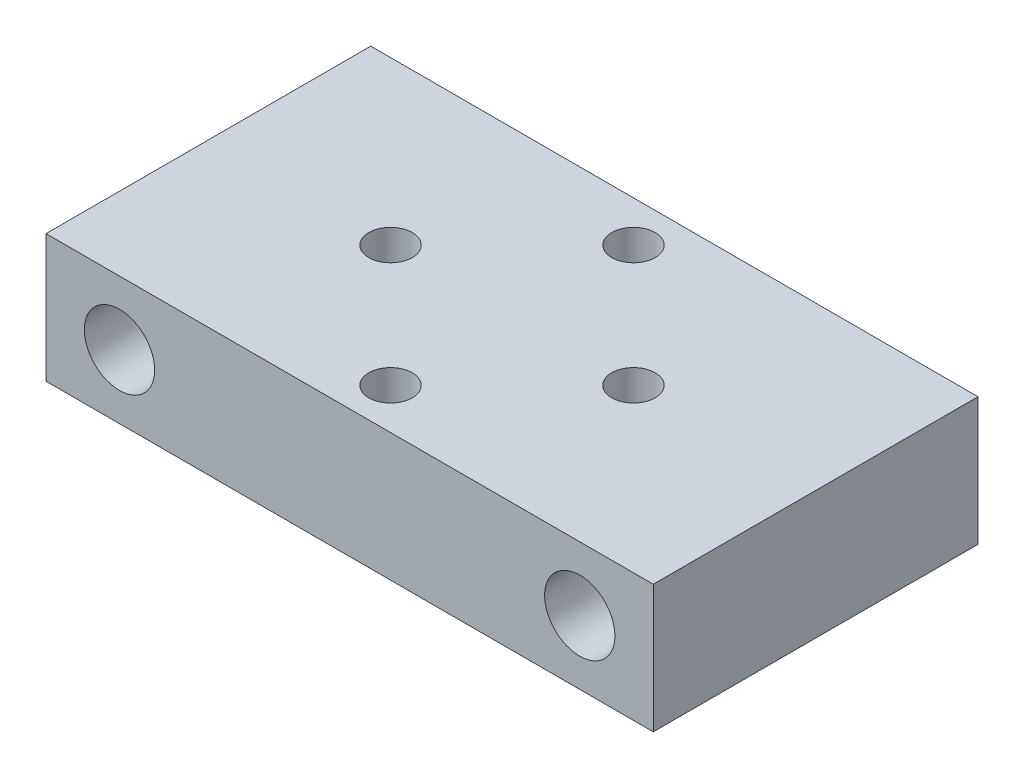
ISO-10303-21;
HEADER;
FILE_DESCRIPTION(('STEP AP214'),'2;1');
FILE_NAME('part.step','',(''),(''),'','','');
FILE_SCHEMA(('AUTOMOTIVE_DESIGN { 1 0 10303 214 1 1 1 1 }'));
ENDSEC;
DATA;
#1=APPLICATION_CONTEXT('core data for automotive mechanical design processes');
#2=APPLICATION_PROTOCOL_DEFINITION('international standard','automotive_design',2000,#1);
#3=PRODUCT_CONTEXT('',#1,'mechanical');
#4=PRODUCT('Part','Part','',(#3));
#5=PRODUCT_RELATED_PRODUCT_CATEGORY('part','',(#4));
#6=PRODUCT_DEFINITION_FORMATION('','',#4);
#7=PRODUCT_DEFINITION_CONTEXT('part definition',#1,'design');
#8=PRODUCT_DEFINITION('design','',#6,#7);
#9=PRODUCT_DEFINITION_SHAPE('','',#8);
#10=(LENGTH_UNIT() NAMED_UNIT(*) SI_UNIT(.MILLI.,.METRE.));
#11=(NAMED_UNIT(*) PLANE_ANGLE_UNIT() SI_UNIT($,.RADIAN.));
#12=(NAMED_UNIT(*) SI_UNIT($,.STERADIAN.) SOLID_ANGLE_UNIT());
#13=UNCERTAINTY_MEASURE_WITH_UNIT(LENGTH_MEASURE(1.E-05),#10,'distance_accuracy_value','');
#14=(GEOMETRIC_REPRESENTATION_CONTEXT(3) GLOBAL_UNCERTAINTY_ASSIGNED_CONTEXT((#13)) GLOBAL_UNIT_ASSIGNED_CONTEXT((#10,
#11,#12)) REPRESENTATION_CONTEXT('',''));
#15=CARTESIAN_POINT('',(0.,0.,0.));
#16=DIRECTION('',(0.,0.,1.));
#17=DIRECTION('',(1.,0.,0.));
#18=AXIS2_PLACEMENT_3D('',#15,#16,#17);
#19=CARTESIAN_POINT('',(-23.75,-5.,-12.7));
#20=DIRECTION('',(-1.,0.,0.));
#21=DIRECTION('',(0.,0.,1.));
#22=AXIS2_PLACEMENT_3D('',#19,#20,#21);
#23=PLANE('',#22);
#24=DIRECTION('',(0.,0.,1.));
#25=VECTOR('',#24,1.);
#26=CARTESIAN_POINT('',(-23.75,5.,-12.7));
#27=LINE('',#26,#25);
#28=CARTESIAN_POINT('',(-23.75,5.,-12.7));
#29=VERTEX_POINT('',#28);
#30=CARTESIAN_POINT('',(-23.75,5.,12.7));
#31=VERTEX_POINT('',#30);
#32=EDGE_CURVE('E156',#29,#31,#27,.T.);
#33=ORIENTED_EDGE('',*,*,#32,.F.);
#34=DIRECTION('',(0.,1.,0.));
#35=VECTOR('',#34,1.);
#36=CARTESIAN_POINT('',(-23.75,-5.,-12.7));
#37=LINE('',#36,#35);
#38=CARTESIAN_POINT('',(-23.75,-5.,-12.7));
#39=VERTEX_POINT('',#38);
#40=EDGE_CURVE('E11',#39,#29,#37,.T.);
#41=ORIENTED_EDGE('',*,*,#40,.F.);
#42=DIRECTION('',(0.,0.,1.));
#43=VECTOR('',#42,1.);
#44=CARTESIAN_POINT('',(-23.75,-5.,-12.7));
#45=LINE('',#44,#43);
#46=CARTESIAN_POINT('',(-23.75,-5.,12.7));
#47=VERTEX_POINT('',#46);
#48=EDGE_CURVE('E157',#39,#47,#45,.T.);
#49=ORIENTED_EDGE('',*,*,#48,.T.);
#50=DIRECTION('',(0.,1.,0.));
#51=VECTOR('',#50,1.);
#52=CARTESIAN_POINT('',(-23.75,-5.,12.7));
#53=LINE('',#52,#51);
#54=EDGE_CURVE('E36',#47,#31,#53,.T.);
#55=ORIENTED_EDGE('',*,*,#54,.T.);
#56=EDGE_LOOP('',(#33,#41,#49,#55));
#57=FACE_BOUND('',#56,.T.);
#58=ADVANCED_FACE('F33',(#57),#23,.T.);
#59=CARTESIAN_POINT('',(-23.75,-5.,-12.7));
#60=DIRECTION('',(0.,0.,-1.));
#61=DIRECTION('',(-1.,0.,0.));
#62=AXIS2_PLACEMENT_3D('',#59,#60,#61);
#63=PLANE('',#62);
#64=CARTESIAN_POINT('',(-18.,0.,-12.7000000000004));
#65=DIRECTION('',(0.,0.,-1.));
#66=DIRECTION('',(-1.,0.,0.));
#67=AXIS2_PLACEMENT_3D('',#64,#65,#66);
#68=CIRCLE('',#67,2.75);
#69=CARTESIAN_POINT('',(-20.75,0.,-12.7000000000004));
#70=VERTEX_POINT('',#69);
#71=EDGE_CURVE('E98',#70,#70,#68,.T.);
#72=ORIENTED_EDGE('',*,*,#71,.F.);
#73=EDGE_LOOP('',(#72));
#74=FACE_BOUND('',#73,.T.);
#75=CARTESIAN_POINT('',(18.,0.,-12.7000000000004));
#76=DIRECTION('',(0.,0.,-1.));
#77=DIRECTION('',(-1.,0.,0.));
#78=AXIS2_PLACEMENT_3D('',#75,#76,#77);
#79=CIRCLE('',#78,2.75);
#80=CARTESIAN_POINT('',(15.25,0.,-12.7000000000004));
#81=VERTEX_POINT('',#80);
#82=EDGE_CURVE('E97',#81,#81,#79,.T.);
#83=ORIENTED_EDGE('',*,*,#82,.F.);
#84=EDGE_LOOP('',(#83));
#85=FACE_BOUND('',#84,.T.);
#86=DIRECTION('',(-1.,0.,0.));
#87=VECTOR('',#86,1.);
#88=CARTESIAN_POINT('',(-23.75,5.,-12.7));
#89=LINE('',#88,#87);
#90=CARTESIAN_POINT('',(23.7499999999999,5.,-12.7));
#91=VERTEX_POINT('',#90);
#92=EDGE_CURVE('E65',#91,#29,#89,.T.);
#93=ORIENTED_EDGE('',*,*,#92,.F.);
#94=DIRECTION('',(0.,1.,0.));
#95=VECTOR('',#94,1.);
#96=CARTESIAN_POINT('',(23.7499999999999,-5.,-12.7));
#97=LINE('',#96,#95);
#98=CARTESIAN_POINT('',(23.7499999999999,-5.,-12.7));
#99=VERTEX_POINT('',#98);
#100=EDGE_CURVE('E42',#99,#91,#97,.T.);
#101=ORIENTED_EDGE('',*,*,#100,.F.);
#102=DIRECTION('',(-1.,0.,0.));
#103=VECTOR('',#102,1.);
#104=CARTESIAN_POINT('',(23.7499999999999,-5.,-12.7));
#105=LINE('',#104,#103);
#106=EDGE_CURVE('E50',#99,#39,#105,.T.);
#107=ORIENTED_EDGE('',*,*,#106,.T.);
#108=ORIENTED_EDGE('',*,*,#40,.T.);
#109=EDGE_LOOP('',(#93,#101,#107,#108));
#110=FACE_BOUND('',#109,.T.);
#111=ADVANCED_FACE('F185',(#74,#85,#110),#63,.T.);
#112=CARTESIAN_POINT('',(23.7499999999999,-5.,-12.7));
#113=DIRECTION('',(1.,0.,0.));
#114=DIRECTION('',(0.,0.,-1.));
#115=AXIS2_PLACEMENT_3D('',#112,#113,#114);
#116=PLANE('',#115);
#117=DIRECTION('',(0.,0.,-1.));
#118=VECTOR('',#117,1.);
#119=CARTESIAN_POINT('',(23.7499999999999,5.,-12.7));
#120=LINE('',#119,#118);
#121=CARTESIAN_POINT('',(23.7500000000001,5.,12.6999999999998));
#122=VERTEX_POINT('',#121);
#123=EDGE_CURVE('E171',#122,#91,#120,.T.);
#124=ORIENTED_EDGE('',*,*,#123,.F.);
#125=DIRECTION('',(0.,1.,0.));
#126=VECTOR('',#125,1.);
#127=CARTESIAN_POINT('',(23.7500000000001,-5.,12.6999999999998));
#128=LINE('',#127,#126);
#129=CARTESIAN_POINT('',(23.7500000000001,-5.,12.6999999999998));
#130=VERTEX_POINT('',#129);
#131=EDGE_CURVE('E175',#130,#122,#128,.T.);
#132=ORIENTED_EDGE('',*,*,#131,.F.);
#133=DIRECTION('',(0.,0.,-1.));
#134=VECTOR('',#133,1.);
#135=CARTESIAN_POINT('',(23.7499999999999,-5.,-12.7));
#136=LINE('',#135,#134);
#137=EDGE_CURVE('E162',#130,#99,#136,.T.);
#138=ORIENTED_EDGE('',*,*,#137,.T.);
#139=ORIENTED_EDGE('',*,*,#100,.T.);
#140=EDGE_LOOP('',(#124,#132,#138,#139));
#141=FACE_BOUND('',#140,.T.);
#142=ADVANCED_FACE('F183',(#141),#116,.T.);
#143=CARTESIAN_POINT('',(23.7500000000001,-5.,12.6999999999998));
#144=DIRECTION('',(0.,0.,1.));
#145=DIRECTION('',(1.,0.,0.));
#146=AXIS2_PLACEMENT_3D('',#143,#144,#145);
#147=PLANE('',#146);
#148=CARTESIAN_POINT('',(-18.,0.,12.7000000000004));
#149=DIRECTION('',(0.,0.,1.));
#150=DIRECTION('',(1.,0.,0.));
#151=AXIS2_PLACEMENT_3D('',#148,#149,#150);
#152=CIRCLE('',#151,2.75);
#153=CARTESIAN_POINT('',(-15.25,0.,12.7000000000004));
#154=VERTEX_POINT('',#153);
#155=EDGE_CURVE('E108',#154,#154,#152,.T.);
#156=ORIENTED_EDGE('',*,*,#155,.F.);
#157=EDGE_LOOP('',(#156));
#158=FACE_BOUND('',#157,.T.);
#159=CARTESIAN_POINT('',(18.,0.,12.7000000000004));
#160=DIRECTION('',(0.,0.,1.));
#161=DIRECTION('',(1.,0.,0.));
#162=AXIS2_PLACEMENT_3D('',#159,#160,#161);
#163=CIRCLE('',#162,2.75);
#164=CARTESIAN_POINT('',(20.75,0.,12.7000000000004));
#165=VERTEX_POINT('',#164);
#166=EDGE_CURVE('E114',#165,#165,#163,.T.);
#167=ORIENTED_EDGE('',*,*,#166,.F.);
#168=EDGE_LOOP('',(#167));
#169=FACE_BOUND('',#168,.T.);
#170=DIRECTION('',(1.,0.,0.));
#171=VECTOR('',#170,1.);
#172=CARTESIAN_POINT('',(23.7500000000001,5.,12.6999999999998));
#173=LINE('',#172,#171);
#174=EDGE_CURVE('E168',#31,#122,#173,.T.);
#175=ORIENTED_EDGE('',*,*,#174,.F.);
#176=ORIENTED_EDGE('',*,*,#54,.F.);
#177=DIRECTION('',(1.,0.,0.));
#178=VECTOR('',#177,1.);
#179=CARTESIAN_POINT('',(-23.75,-5.,12.7));
#180=LINE('',#179,#178);
#181=EDGE_CURVE('E160',#47,#130,#180,.T.);
#182=ORIENTED_EDGE('',*,*,#181,.T.);
#183=ORIENTED_EDGE('',*,*,#131,.T.);
#184=EDGE_LOOP('',(#175,#176,#182,#183));
#185=FACE_BOUND('',#184,.T.);
#186=ADVANCED_FACE('F188',(#158,#169,#185),#147,.T.);
#187=CARTESIAN_POINT('',(0.,-5.,0.));
#188=DIRECTION('',(0.,1.,0.));
#189=DIRECTION('',(0.,0.,1.));
#190=AXIS2_PLACEMENT_3D('',#187,#188,#189);
#191=PLANE('',#190);
#192=CARTESIAN_POINT('',(9.5,-5.,0.));
#193=DIRECTION('',(0.,-1.,0.));
#194=DIRECTION('',(0.,0.,-1.));
#195=AXIS2_PLACEMENT_3D('',#192,#193,#194);
#196=CIRCLE('',#195,3.15);
#197=CARTESIAN_POINT('',(9.5,-5.,-3.15));
#198=VERTEX_POINT('',#197);
#199=EDGE_CURVE('E120',#198,#198,#196,.T.);
#200=ORIENTED_EDGE('',*,*,#199,.F.);
#201=EDGE_LOOP('',(#200));
#202=FACE_BOUND('',#201,.T.);
#203=CARTESIAN_POINT('',(0.,-5.,-9.5));
#204=DIRECTION('',(0.,-1.,0.));
#205=DIRECTION('',(0.,0.,-1.));
#206=AXIS2_PLACEMENT_3D('',#203,#204,#205);
#207=CIRCLE('',#206,3.15);
#208=CARTESIAN_POINT('',(0.,-5.,-12.65));
#209=VERTEX_POINT('',#208);
#210=EDGE_CURVE('E129',#209,#209,#207,.T.);
#211=ORIENTED_EDGE('',*,*,#210,.F.);
#212=EDGE_LOOP('',(#211));
#213=FACE_BOUND('',#212,.T.);
#214=CARTESIAN_POINT('',(-9.5,-5.,0.));
#215=DIRECTION('',(0.,-1.,0.));
#216=DIRECTION('',(0.,0.,-1.));
#217=AXIS2_PLACEMENT_3D('',#214,#215,#216);
#218=CIRCLE('',#217,3.15);
#219=CARTESIAN_POINT('',(-9.5,-5.,-3.15));
#220=VERTEX_POINT('',#219);
#221=EDGE_CURVE('E138',#220,#220,#218,.T.);
#222=ORIENTED_EDGE('',*,*,#221,.F.);
#223=EDGE_LOOP('',(#222));
#224=FACE_BOUND('',#223,.T.);
#225=CARTESIAN_POINT('',(0.,-5.,9.5));
#226=DIRECTION('',(0.,-1.,0.));
#227=DIRECTION('',(0.,0.,-1.));
#228=AXIS2_PLACEMENT_3D('',#225,#226,#227);
#229=CIRCLE('',#228,3.15);
#230=CARTESIAN_POINT('',(0.,-5.,6.35));
#231=VERTEX_POINT('',#230);
#232=EDGE_CURVE('E147',#231,#231,#229,.T.);
#233=ORIENTED_EDGE('',*,*,#232,.F.);
#234=EDGE_LOOP('',(#233));
#235=FACE_BOUND('',#234,.T.);
#236=ORIENTED_EDGE('',*,*,#48,.F.);
#237=ORIENTED_EDGE('',*,*,#106,.F.);
#238=ORIENTED_EDGE('',*,*,#137,.F.);
#239=ORIENTED_EDGE('',*,*,#181,.F.);
#240=EDGE_LOOP('',(#236,#237,#238,#239));
#241=FACE_BOUND('',#240,.T.);
#242=ADVANCED_FACE('F187',(#202,#213,#224,#235,#241),#191,.F.);
#243=CARTESIAN_POINT('',(0.,5.,0.));
#244=DIRECTION('',(0.,1.,0.));
#245=DIRECTION('',(0.,0.,1.));
#246=AXIS2_PLACEMENT_3D('',#243,#244,#245);
#247=PLANE('',#246);
#248=CARTESIAN_POINT('',(9.5,5.,0.));
#249=DIRECTION('',(0.,-1.,0.));
#250=DIRECTION('',(0.,0.,-1.));
#251=AXIS2_PLACEMENT_3D('',#248,#249,#250);
#252=CIRCLE('',#251,1.7);
#253=CARTESIAN_POINT('',(9.5,5.,-1.7));
#254=VERTEX_POINT('',#253);
#255=EDGE_CURVE('E126',#254,#254,#252,.T.);
#256=ORIENTED_EDGE('',*,*,#255,.T.);
#257=EDGE_LOOP('',(#256));
#258=FACE_BOUND('',#257,.T.);
#259=CARTESIAN_POINT('',(0.,5.,-9.5));
#260=DIRECTION('',(0.,-1.,0.));
#261=DIRECTION('',(0.,0.,-1.));
#262=AXIS2_PLACEMENT_3D('',#259,#260,#261);
#263=CIRCLE('',#262,1.7);
#264=CARTESIAN_POINT('',(0.,5.,-11.2));
#265=VERTEX_POINT('',#264);
#266=EDGE_CURVE('E135',#265,#265,#263,.T.);
#267=ORIENTED_EDGE('',*,*,#266,.T.);
#268=EDGE_LOOP('',(#267));
#269=FACE_BOUND('',#268,.T.);
#270=CARTESIAN_POINT('',(-9.5,5.,0.));
#271=DIRECTION('',(0.,-1.,0.));
#272=DIRECTION('',(0.,0.,-1.));
#273=AXIS2_PLACEMENT_3D('',#270,#271,#272);
#274=CIRCLE('',#273,1.7);
#275=CARTESIAN_POINT('',(-9.5,5.,-1.7));
#276=VERTEX_POINT('',#275);
#277=EDGE_CURVE('E144',#276,#276,#274,.T.);
#278=ORIENTED_EDGE('',*,*,#277,.T.);
#279=EDGE_LOOP('',(#278));
#280=FACE_BOUND('',#279,.T.);
#281=CARTESIAN_POINT('',(0.,5.,9.5));
#282=DIRECTION('',(0.,-1.,0.));
#283=DIRECTION('',(0.,0.,-1.));
#284=AXIS2_PLACEMENT_3D('',#281,#282,#283);
#285=CIRCLE('',#284,1.7);
#286=CARTESIAN_POINT('',(0.,5.,7.8));
#287=VERTEX_POINT('',#286);
#288=EDGE_CURVE('E153',#287,#287,#285,.T.);
#289=ORIENTED_EDGE('',*,*,#288,.T.);
#290=EDGE_LOOP('',(#289));
#291=FACE_BOUND('',#290,.T.);
#292=ORIENTED_EDGE('',*,*,#32,.T.);
#293=ORIENTED_EDGE('',*,*,#174,.T.);
#294=ORIENTED_EDGE('',*,*,#123,.T.);
#295=ORIENTED_EDGE('',*,*,#92,.T.);
#296=EDGE_LOOP('',(#292,#293,#294,#295));
#297=FACE_BOUND('',#296,.T.);
#298=ADVANCED_FACE('F181',(#258,#269,#280,#291,#297),#247,.T.);
#299=CARTESIAN_POINT('',(0.,-5.,9.5));
#300=DIRECTION('',(0.,-1.,0.));
#301=DIRECTION('',(0.,0.,-1.));
#302=AXIS2_PLACEMENT_3D('',#299,#300,#301);
#303=CYLINDRICAL_SURFACE('',#302,1.7);
#304=ORIENTED_EDGE('',*,*,#288,.F.);
#305=EDGE_LOOP('',(#304));
#306=FACE_BOUND('',#305,.T.);
#307=CARTESIAN_POINT('',(0.,-3.55,9.5));
#308=DIRECTION('',(0.,-1.,0.));
#309=DIRECTION('',(0.,0.,-1.));
#310=AXIS2_PLACEMENT_3D('',#307,#308,#309);
#311=CIRCLE('',#310,1.7);
#312=CARTESIAN_POINT('',(0.,-3.55,7.8));
#313=VERTEX_POINT('',#312);
#314=EDGE_CURVE('E150',#313,#313,#311,.T.);
#315=ORIENTED_EDGE('',*,*,#314,.T.);
#316=EDGE_LOOP('',(#315));
#317=FACE_BOUND('',#316,.T.);
#318=ADVANCED_FACE('F212',(#306,#317),#303,.F.);
#319=CARTESIAN_POINT('',(0.,-5.,9.5));
#320=DIRECTION('',(0.,-1.,0.));
#321=DIRECTION('',(0.,0.,-1.));
#322=AXIS2_PLACEMENT_3D('',#319,#320,#321);
#323=CONICAL_SURFACE('',#322,3.15,0.785398163397447);
#324=ORIENTED_EDGE('',*,*,#314,.F.);
#325=EDGE_LOOP('',(#324));
#326=FACE_BOUND('',#325,.T.);
#327=ORIENTED_EDGE('',*,*,#232,.T.);
#328=EDGE_LOOP('',(#327));
#329=FACE_BOUND('',#328,.T.);
#330=ADVANCED_FACE('F217',(#326,#329),#323,.F.);
#331=CARTESIAN_POINT('',(-9.5,-5.,0.));
#332=DIRECTION('',(0.,-1.,0.));
#333=DIRECTION('',(0.,0.,-1.));
#334=AXIS2_PLACEMENT_3D('',#331,#332,#333);
#335=CYLINDRICAL_SURFACE('',#334,1.7);
#336=ORIENTED_EDGE('',*,*,#277,.F.);
#337=EDGE_LOOP('',(#336));
#338=FACE_BOUND('',#337,.T.);
#339=CARTESIAN_POINT('',(-9.5,-3.55,0.));
#340=DIRECTION('',(0.,-1.,0.));
#341=DIRECTION('',(0.,0.,-1.));
#342=AXIS2_PLACEMENT_3D('',#339,#340,#341);
#343=CIRCLE('',#342,1.7);
#344=CARTESIAN_POINT('',(-9.5,-3.55,-1.7));
#345=VERTEX_POINT('',#344);
#346=EDGE_CURVE('E141',#345,#345,#343,.T.);
#347=ORIENTED_EDGE('',*,*,#346,.T.);
#348=EDGE_LOOP('',(#347));
#349=FACE_BOUND('',#348,.T.);
#350=ADVANCED_FACE('F221',(#338,#349),#335,.F.);
#351=CARTESIAN_POINT('',(-9.5,-5.,0.));
#352=DIRECTION('',(0.,-1.,0.));
#353=DIRECTION('',(0.,0.,-1.));
#354=AXIS2_PLACEMENT_3D('',#351,#352,#353);
#355=CONICAL_SURFACE('',#354,3.15,0.785398163397447);
#356=ORIENTED_EDGE('',*,*,#346,.F.);
#357=EDGE_LOOP('',(#356));
#358=FACE_BOUND('',#357,.T.);
#359=ORIENTED_EDGE('',*,*,#221,.T.);
#360=EDGE_LOOP('',(#359));
#361=FACE_BOUND('',#360,.T.);
#362=ADVANCED_FACE('F225',(#358,#361),#355,.F.);
#363=CARTESIAN_POINT('',(0.,-5.,-9.5));
#364=DIRECTION('',(0.,-1.,0.));
#365=DIRECTION('',(0.,0.,-1.));
#366=AXIS2_PLACEMENT_3D('',#363,#364,#365);
#367=CYLINDRICAL_SURFACE('',#366,1.7);
#368=ORIENTED_EDGE('',*,*,#266,.F.);
#369=EDGE_LOOP('',(#368));
#370=FACE_BOUND('',#369,.T.);
#371=CARTESIAN_POINT('',(0.,-3.55,-9.5));
#372=DIRECTION('',(0.,-1.,0.));
#373=DIRECTION('',(0.,0.,-1.));
#374=AXIS2_PLACEMENT_3D('',#371,#372,#373);
#375=CIRCLE('',#374,1.7);
#376=CARTESIAN_POINT('',(0.,-3.55,-11.2));
#377=VERTEX_POINT('',#376);
#378=EDGE_CURVE('E132',#377,#377,#375,.T.);
#379=ORIENTED_EDGE('',*,*,#378,.T.);
#380=EDGE_LOOP('',(#379));
#381=FACE_BOUND('',#380,.T.);
#382=ADVANCED_FACE('F229',(#370,#381),#367,.F.);
#383=CARTESIAN_POINT('',(0.,-5.,-9.5));
#384=DIRECTION('',(0.,-1.,0.));
#385=DIRECTION('',(0.,0.,-1.));
#386=AXIS2_PLACEMENT_3D('',#383,#384,#385);
#387=CONICAL_SURFACE('',#386,3.15,0.785398163397447);
#388=ORIENTED_EDGE('',*,*,#378,.F.);
#389=EDGE_LOOP('',(#388));
#390=FACE_BOUND('',#389,.T.);
#391=ORIENTED_EDGE('',*,*,#210,.T.);
#392=EDGE_LOOP('',(#391));
#393=FACE_BOUND('',#392,.T.);
#394=ADVANCED_FACE('F233',(#390,#393),#387,.F.);
#395=CARTESIAN_POINT('',(9.5,-5.,0.));
#396=DIRECTION('',(0.,-1.,0.));
#397=DIRECTION('',(0.,0.,-1.));
#398=AXIS2_PLACEMENT_3D('',#395,#396,#397);
#399=CYLINDRICAL_SURFACE('',#398,1.7);
#400=ORIENTED_EDGE('',*,*,#255,.F.);
#401=EDGE_LOOP('',(#400));
#402=FACE_BOUND('',#401,.T.);
#403=CARTESIAN_POINT('',(9.5,-3.55,0.));
#404=DIRECTION('',(0.,-1.,0.));
#405=DIRECTION('',(0.,0.,-1.));
#406=AXIS2_PLACEMENT_3D('',#403,#404,#405);
#407=CIRCLE('',#406,1.7);
#408=CARTESIAN_POINT('',(9.5,-3.55,-1.7));
#409=VERTEX_POINT('',#408);
#410=EDGE_CURVE('E123',#409,#409,#407,.T.);
#411=ORIENTED_EDGE('',*,*,#410,.T.);
#412=EDGE_LOOP('',(#411));
#413=FACE_BOUND('',#412,.T.);
#414=ADVANCED_FACE('F237',(#402,#413),#399,.F.);
#415=CARTESIAN_POINT('',(9.5,-5.,0.));
#416=DIRECTION('',(0.,-1.,0.));
#417=DIRECTION('',(0.,0.,-1.));
#418=AXIS2_PLACEMENT_3D('',#415,#416,#417);
#419=CONICAL_SURFACE('',#418,3.15,0.785398163397447);
#420=ORIENTED_EDGE('',*,*,#410,.F.);
#421=EDGE_LOOP('',(#420));
#422=FACE_BOUND('',#421,.T.);
#423=ORIENTED_EDGE('',*,*,#199,.T.);
#424=EDGE_LOOP('',(#423));
#425=FACE_BOUND('',#424,.T.);
#426=ADVANCED_FACE('F241',(#422,#425),#419,.F.);
#427=CARTESIAN_POINT('',(18.,0.,2.7000000000004));
#428=DIRECTION('',(0.,0.,1.));
#429=DIRECTION('',(1.,0.,0.));
#430=AXIS2_PLACEMENT_3D('',#427,#428,#429);
#431=CONICAL_SURFACE('',#430,2.75,1.02974425867665);
#432=CARTESIAN_POINT('',(18.,0.,1.04763329767461));
#433=VERTEX_POINT('',#432);
#434=VERTEX_LOOP('',#433);
#435=FACE_BOUND('',#434,.T.);
#436=CARTESIAN_POINT('',(18.,0.,2.7000000000004));
#437=DIRECTION('',(0.,0.,1.));
#438=DIRECTION('',(1.,0.,0.));
#439=AXIS2_PLACEMENT_3D('',#436,#437,#438);
#440=CIRCLE('',#439,2.75);
#441=CARTESIAN_POINT('',(20.75,0.,2.7000000000004));
#442=VERTEX_POINT('',#441);
#443=EDGE_CURVE('E117',#442,#442,#440,.T.);
#444=ORIENTED_EDGE('',*,*,#443,.T.);
#445=EDGE_LOOP('',(#444));
#446=FACE_BOUND('',#445,.T.);
#447=ADVANCED_FACE('F245',(#435,#446),#431,.F.);
#448=CARTESIAN_POINT('',(18.,0.,12.7000000000004));
#449=DIRECTION('',(0.,0.,1.));
#450=DIRECTION('',(1.,0.,0.));
#451=AXIS2_PLACEMENT_3D('',#448,#449,#450);
#452=CYLINDRICAL_SURFACE('',#451,2.75);
#453=ORIENTED_EDGE('',*,*,#443,.F.);
#454=EDGE_LOOP('',(#453));
#455=FACE_BOUND('',#454,.T.);
#456=ORIENTED_EDGE('',*,*,#166,.T.);
#457=EDGE_LOOP('',(#456));
#458=FACE_BOUND('',#457,.T.);
#459=ADVANCED_FACE('F249',(#455,#458),#452,.F.);
#460=CARTESIAN_POINT('',(-18.,0.,2.7000000000004));
#461=DIRECTION('',(0.,0.,1.));
#462=DIRECTION('',(1.,0.,0.));
#463=AXIS2_PLACEMENT_3D('',#460,#461,#462);
#464=CONICAL_SURFACE('',#463,2.75,1.02974425867665);
#465=CARTESIAN_POINT('',(-18.,0.,1.04763329767461));
#466=VERTEX_POINT('',#465);
#467=VERTEX_LOOP('',#466);
#468=FACE_BOUND('',#467,.T.);
#469=CARTESIAN_POINT('',(-18.,0.,2.7000000000004));
#470=DIRECTION('',(0.,0.,1.));
#471=DIRECTION('',(1.,0.,0.));
#472=AXIS2_PLACEMENT_3D('',#469,#470,#471);
#473=CIRCLE('',#472,2.75);
#474=CARTESIAN_POINT('',(-15.25,0.,2.7000000000004));
#475=VERTEX_POINT('',#474);
#476=EDGE_CURVE('E111',#475,#475,#473,.T.);
#477=ORIENTED_EDGE('',*,*,#476,.T.);
#478=EDGE_LOOP('',(#477));
#479=FACE_BOUND('',#478,.T.);
#480=ADVANCED_FACE('F253',(#468,#479),#464,.F.);
#481=CARTESIAN_POINT('',(-18.,0.,12.7000000000004));
#482=DIRECTION('',(0.,0.,1.));
#483=DIRECTION('',(1.,0.,0.));
#484=AXIS2_PLACEMENT_3D('',#481,#482,#483);
#485=CYLINDRICAL_SURFACE('',#484,2.75);
#486=ORIENTED_EDGE('',*,*,#476,.F.);
#487=EDGE_LOOP('',(#486));
#488=FACE_BOUND('',#487,.T.);
#489=ORIENTED_EDGE('',*,*,#155,.T.);
#490=EDGE_LOOP('',(#489));
#491=FACE_BOUND('',#490,.T.);
#492=ADVANCED_FACE('F257',(#488,#491),#485,.F.);
#493=CARTESIAN_POINT('',(18.,0.,-2.7000000000004));
#494=DIRECTION('',(0.,0.,-1.));
#495=DIRECTION('',(-1.,0.,0.));
#496=AXIS2_PLACEMENT_3D('',#493,#494,#495);
#497=CONICAL_SURFACE('',#496,2.75,1.02974425867665);
#498=CARTESIAN_POINT('',(18.,0.,-1.04763329767461));
#499=VERTEX_POINT('',#498);
#500=VERTEX_LOOP('',#499);
#501=FACE_BOUND('',#500,.T.);
#502=CARTESIAN_POINT('',(18.,0.,-2.7000000000004));
#503=DIRECTION('',(0.,0.,-1.));
#504=DIRECTION('',(-1.,0.,0.));
#505=AXIS2_PLACEMENT_3D('',#502,#503,#504);
#506=CIRCLE('',#505,2.75);
#507=CARTESIAN_POINT('',(15.25,0.,-2.7000000000004));
#508=VERTEX_POINT('',#507);
#509=EDGE_CURVE('E101',#508,#508,#506,.T.);
#510=ORIENTED_EDGE('',*,*,#509,.T.);
#511=EDGE_LOOP('',(#510));
#512=FACE_BOUND('',#511,.T.);
#513=ADVANCED_FACE('F261',(#501,#512),#497,.F.);
#514=CARTESIAN_POINT('',(18.,0.,-12.7000000000004));
#515=DIRECTION('',(0.,0.,-1.));
#516=DIRECTION('',(-1.,0.,0.));
#517=AXIS2_PLACEMENT_3D('',#514,#515,#516);
#518=CYLINDRICAL_SURFACE('',#517,2.75);
#519=ORIENTED_EDGE('',*,*,#509,.F.);
#520=EDGE_LOOP('',(#519));
#521=FACE_BOUND('',#520,.T.);
#522=ORIENTED_EDGE('',*,*,#82,.T.);
#523=EDGE_LOOP('',(#522));
#524=FACE_BOUND('',#523,.T.);
#525=ADVANCED_FACE('F91',(#521,#524),#518,.F.);
#526=CARTESIAN_POINT('',(-18.,0.,-2.7000000000004));
#527=DIRECTION('',(0.,0.,-1.));
#528=DIRECTION('',(-1.,0.,0.));
#529=AXIS2_PLACEMENT_3D('',#526,#527,#528);
#530=CONICAL_SURFACE('',#529,2.75,1.02974425867665);
#531=CARTESIAN_POINT('',(-18.,0.,-1.04763329767461));
#532=VERTEX_POINT('',#531);
#533=VERTEX_LOOP('',#532);
#534=FACE_BOUND('',#533,.T.);
#535=CARTESIAN_POINT('',(-18.,0.,-2.7000000000004));
#536=DIRECTION('',(0.,0.,-1.));
#537=DIRECTION('',(-1.,0.,0.));
#538=AXIS2_PLACEMENT_3D('',#535,#536,#537);
#539=CIRCLE('',#538,2.75);
#540=CARTESIAN_POINT('',(-20.75,0.,-2.7000000000004));
#541=VERTEX_POINT('',#540);
#542=EDGE_CURVE('E95',#541,#541,#539,.T.);
#543=ORIENTED_EDGE('',*,*,#542,.T.);
#544=EDGE_LOOP('',(#543));
#545=FACE_BOUND('',#544,.T.);
#546=ADVANCED_FACE('F87',(#534,#545),#530,.F.);
#547=CARTESIAN_POINT('',(-18.,0.,-12.7000000000004));
#548=DIRECTION('',(0.,0.,-1.));
#549=DIRECTION('',(-1.,0.,0.));
#550=AXIS2_PLACEMENT_3D('',#547,#548,#549);
#551=CYLINDRICAL_SURFACE('',#550,2.75);
#552=ORIENTED_EDGE('',*,*,#542,.F.);
#553=EDGE_LOOP('',(#552));
#554=FACE_BOUND('',#553,.T.);
#555=ORIENTED_EDGE('',*,*,#71,.T.);
#556=EDGE_LOOP('',(#555));
#557=FACE_BOUND('',#556,.T.);
#558=ADVANCED_FACE('F90',(#554,#557),#551,.F.);
#559=CLOSED_SHELL('',(#58,#111,#142,#186,#242,#298,#318,#330,#350,#362,#382,#394,#414,#426,#447,
#459,#480,#492,#513,#525,#546,#558));
#560=MANIFOLD_SOLID_BREP('B2',#559);
#561=ADVANCED_BREP_SHAPE_REPRESENTATION('',(#18,#560),#14);
#562=SHAPE_DEFINITION_REPRESENTATION(#9,#561);
ENDSEC;
END-ISO-10303-21;
